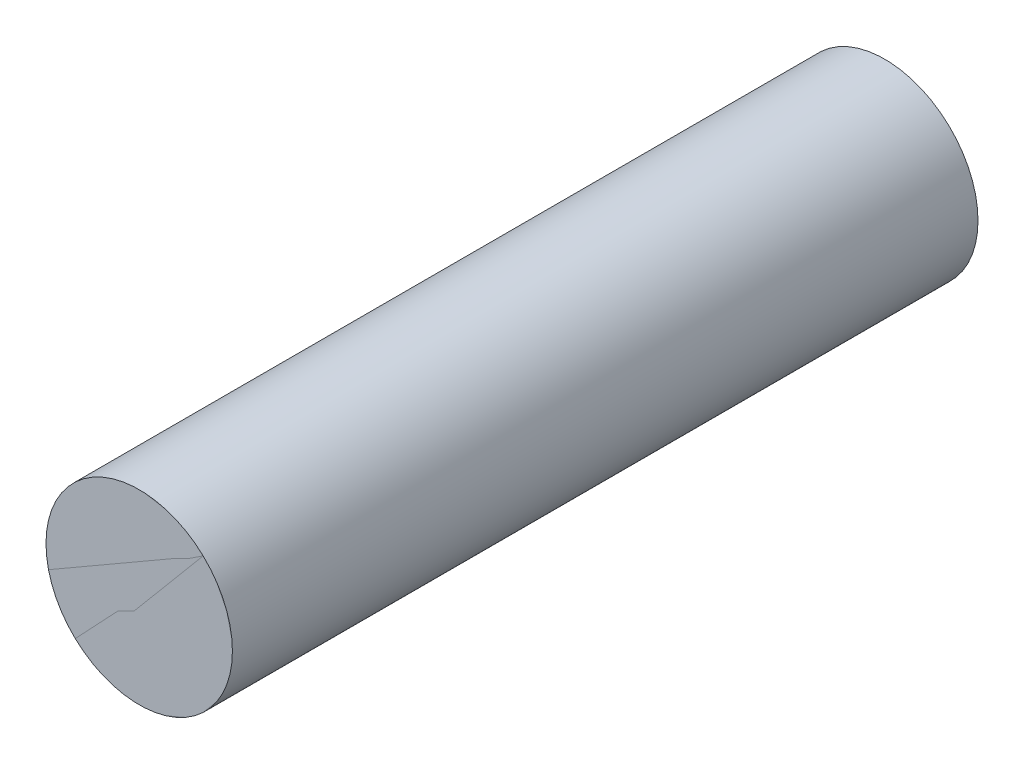
ISO-10303-21;
HEADER;
FILE_DESCRIPTION(('STEP AP214'),'2;1');
FILE_NAME('part.step','',(''),(''),'','','');
FILE_SCHEMA(('AUTOMOTIVE_DESIGN { 1 0 10303 214 1 1 1 1 }'));
ENDSEC;
DATA;
#1=APPLICATION_CONTEXT('core data for automotive mechanical design processes');
#2=APPLICATION_PROTOCOL_DEFINITION('international standard','automotive_design',2000,#1);
#3=PRODUCT_CONTEXT('',#1,'mechanical');
#4=PRODUCT('Part','Part','',(#3));
#5=PRODUCT_RELATED_PRODUCT_CATEGORY('part','',(#4));
#6=PRODUCT_DEFINITION_FORMATION('','',#4);
#7=PRODUCT_DEFINITION_CONTEXT('part definition',#1,'design');
#8=PRODUCT_DEFINITION('design','',#6,#7);
#9=PRODUCT_DEFINITION_SHAPE('','',#8);
#10=(LENGTH_UNIT() NAMED_UNIT(*) SI_UNIT(.MILLI.,.METRE.));
#11=(NAMED_UNIT(*) PLANE_ANGLE_UNIT() SI_UNIT($,.RADIAN.));
#12=(NAMED_UNIT(*) SI_UNIT($,.STERADIAN.) SOLID_ANGLE_UNIT());
#13=UNCERTAINTY_MEASURE_WITH_UNIT(LENGTH_MEASURE(1.E-05),#10,'distance_accuracy_value','');
#14=(GEOMETRIC_REPRESENTATION_CONTEXT(3) GLOBAL_UNCERTAINTY_ASSIGNED_CONTEXT((#13)) GLOBAL_UNIT_ASSIGNED_CONTEXT((#10,
#11,#12)) REPRESENTATION_CONTEXT('',''));
#15=CARTESIAN_POINT('',(0.,0.,0.));
#16=DIRECTION('',(0.,0.,1.));
#17=DIRECTION('',(1.,0.,0.));
#18=AXIS2_PLACEMENT_3D('',#15,#16,#17);
#19=CARTESIAN_POINT('',(-75.4181941684056,-38.9144186635382,-5.29999999999908));
#20=DIRECTION('',(0.,0.,1.));
#21=DIRECTION('',(1.,0.,0.));
#22=AXIS2_PLACEMENT_3D('',#19,#20,#21);
#23=CYLINDRICAL_SURFACE('',#22,0.225000000000002);
#24=CARTESIAN_POINT('',(-75.4181941684056,-38.9144186635382,-5.29999999999908));
#25=DIRECTION('',(0.,0.,1.));
#26=DIRECTION('',(1.,0.,0.));
#27=AXIS2_PLACEMENT_3D('',#24,#25,#26);
#28=CIRCLE('',#27,0.225000000000002);
#29=CARTESIAN_POINT('',(-75.1931941684056,-38.9144186635382,-5.29999999999908));
#30=VERTEX_POINT('',#29);
#31=EDGE_CURVE('E11',#30,#30,#28,.T.);
#32=ORIENTED_EDGE('',*,*,#31,.T.);
#33=EDGE_LOOP('',(#32));
#34=FACE_BOUND('',#33,.T.);
#35=CARTESIAN_POINT('',(-75.4181941684056,-38.9144186635382,-3.49999999999908));
#36=DIRECTION('',(0.,0.,1.));
#37=DIRECTION('',(1.,0.,0.));
#38=AXIS2_PLACEMENT_3D('',#35,#36,#37);
#39=CIRCLE('',#38,0.225000000000002);
#40=CARTESIAN_POINT('',(-75.1931941684056,-38.9144186635382,-3.49999999999908));
#41=VERTEX_POINT('',#40);
#42=EDGE_CURVE('E46',#41,#41,#39,.T.);
#43=ORIENTED_EDGE('',*,*,#42,.F.);
#44=EDGE_LOOP('',(#43));
#45=FACE_BOUND('',#44,.T.);
#46=ADVANCED_FACE('F43',(#34,#45),#23,.T.);
#47=CARTESIAN_POINT('',(-75.4181941684056,-38.9144186635382,-5.29999999999908));
#48=DIRECTION('',(0.,0.,1.));
#49=DIRECTION('',(1.,0.,0.));
#50=AXIS2_PLACEMENT_3D('',#47,#48,#49);
#51=PLANE('',#50);
#52=ORIENTED_EDGE('',*,*,#31,.F.);
#53=EDGE_LOOP('',(#52));
#54=FACE_BOUND('',#53,.T.);
#55=ADVANCED_FACE('F58',(#54),#51,.F.);
#56=CARTESIAN_POINT('',(-75.4181941684056,-38.9144186635382,-3.49999999999908));
#57=DIRECTION('',(0.,0.,1.));
#58=DIRECTION('',(1.,0.,0.));
#59=AXIS2_PLACEMENT_3D('',#56,#57,#58);
#60=PLANE('',#59);
#61=ORIENTED_EDGE('',*,*,#42,.T.);
#62=EDGE_LOOP('',(#61));
#63=FACE_BOUND('',#62,.T.);
#64=ADVANCED_FACE('F55',(#63),#60,.T.);
#65=CLOSED_SHELL('',(#46,#55,#64));
#66=MANIFOLD_SOLID_BREP('B2',#65);
#67=CARTESIAN_POINT('',(-75.4181941684056,-38.9144186635382,-3.49999999999908));
#68=DIRECTION('',(0.,0.,1.));
#69=DIRECTION('',(1.,0.,0.));
#70=AXIS2_PLACEMENT_3D('',#67,#68,#69);
#71=PLANE('',#70);
#72=CARTESIAN_POINT('',(-75.4181941684056,-38.9144186635382,-3.49999999999908));
#73=DIRECTION('',(0.,0.,1.));
#74=DIRECTION('',(1.,0.,0.));
#75=AXIS2_PLACEMENT_3D('',#72,#73,#74);
#76=CIRCLE('',#75,0.225000000000003);
#77=CARTESIAN_POINT('',(-75.1931941684056,-38.9144186635382,-3.49999999999908));
#78=VERTEX_POINT('',#77);
#79=EDGE_CURVE('E42',#78,#78,#76,.F.);
#80=ORIENTED_EDGE('',*,*,#79,.F.);
#81=EDGE_LOOP('',(#80));
#82=FACE_BOUND('',#81,.T.);
#83=ADVANCED_FACE('F83',(#82),#71,.T.);
#84=OPEN_SHELL('',(#83));
#85=SHELL_BASED_SURFACE_MODEL('B6',(#84));
#86=ADVANCED_BREP_SHAPE_REPRESENTATION('',(#18,#66),#14);
#87=MANIFOLD_SURFACE_SHAPE_REPRESENTATION('',(#18,#85),#14);
#88=SHAPE_REPRESENTATION('',(#18),#14);
#89=SHAPE_DEFINITION_REPRESENTATION(#9,#88);
#90=SHAPE_REPRESENTATION_RELATIONSHIP('','',#88,#86);
#91=SHAPE_REPRESENTATION_RELATIONSHIP('','',#88,#87);
ENDSEC;
END-ISO-10303-21;
